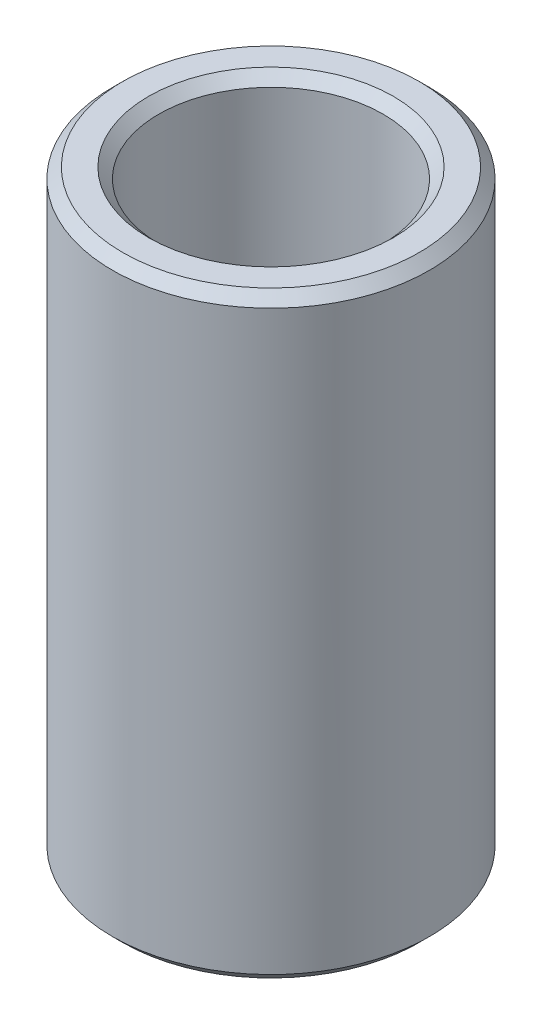
ISO-10303-21;
HEADER;
FILE_DESCRIPTION(('STEP AP214'),'2;1');
FILE_NAME('part.step','',(''),(''),'','','');
FILE_SCHEMA(('AUTOMOTIVE_DESIGN { 1 0 10303 214 1 1 1 1 }'));
ENDSEC;
DATA;
#1=APPLICATION_CONTEXT('core data for automotive mechanical design processes');
#2=APPLICATION_PROTOCOL_DEFINITION('international standard','automotive_design',2000,#1);
#3=PRODUCT_CONTEXT('',#1,'mechanical');
#4=PRODUCT('Part','Part','',(#3));
#5=PRODUCT_RELATED_PRODUCT_CATEGORY('part','',(#4));
#6=PRODUCT_DEFINITION_FORMATION('','',#4);
#7=PRODUCT_DEFINITION_CONTEXT('part definition',#1,'design');
#8=PRODUCT_DEFINITION('design','',#6,#7);
#9=PRODUCT_DEFINITION_SHAPE('','',#8);
#10=(LENGTH_UNIT() NAMED_UNIT(*) SI_UNIT(.MILLI.,.METRE.));
#11=(NAMED_UNIT(*) PLANE_ANGLE_UNIT() SI_UNIT($,.RADIAN.));
#12=(NAMED_UNIT(*) SI_UNIT($,.STERADIAN.) SOLID_ANGLE_UNIT());
#13=UNCERTAINTY_MEASURE_WITH_UNIT(LENGTH_MEASURE(1.E-05),#10,'distance_accuracy_value','');
#14=(GEOMETRIC_REPRESENTATION_CONTEXT(3) GLOBAL_UNCERTAINTY_ASSIGNED_CONTEXT((#13)) GLOBAL_UNIT_ASSIGNED_CONTEXT((#10,
#11,#12)) REPRESENTATION_CONTEXT('',''));
#15=CARTESIAN_POINT('',(0.,0.,0.));
#16=DIRECTION('',(0.,0.,1.));
#17=DIRECTION('',(1.,0.,0.));
#18=AXIS2_PLACEMENT_3D('',#15,#16,#17);
#19=CARTESIAN_POINT('',(0.,122.542267193147,0.));
#20=DIRECTION('',(0.,-1.,0.));
#21=DIRECTION('',(0.,0.,-1.));
#22=AXIS2_PLACEMENT_3D('',#19,#20,#21);
#23=CYLINDRICAL_SURFACE('',#22,32.5);
#24=CARTESIAN_POINT('',(0.,2.10416210140545,0.));
#25=DIRECTION('',(0.,1.,0.));
#26=DIRECTION('',(0.,0.,1.));
#27=AXIS2_PLACEMENT_3D('',#24,#25,#26);
#28=CIRCLE('',#27,32.5);
#29=CARTESIAN_POINT('',(0.,2.10416210140545,-32.5));
#30=VERTEX_POINT('',#29);
#31=EDGE_CURVE('E10',#30,#30,#28,.T.);
#32=CARTESIAN_POINT('',(0.,120.438105091742,0.));
#33=DIRECTION('',(0.,1.,0.));
#34=DIRECTION('',(0.,0.,1.));
#35=AXIS2_PLACEMENT_3D('',#32,#33,#34);
#36=CIRCLE('',#35,32.5);
#37=CARTESIAN_POINT('',(0.,120.438105091742,-32.5));
#38=VERTEX_POINT('',#37);
#39=EDGE_CURVE('E50',#38,#38,#36,.F.);
#40=CARTESIAN_POINT('',(0.,2.10416210140545,-32.5));
#41=CARTESIAN_POINT('',(0.,3.33680734088812,-32.5));
#42=CARTESIAN_POINT('',(0.,4.56945258037079,-32.5));
#43=CARTESIAN_POINT('',(0.,7.03474305933612,-32.5));
#44=CARTESIAN_POINT('',(0.,8.26738829881879,-32.5));
#45=CARTESIAN_POINT('',(0.,10.7326787777841,-32.5));
#46=CARTESIAN_POINT('',(0.,11.9653240172668,-32.5));
#47=CARTESIAN_POINT('',(0.,14.4306144962322,-32.5));
#48=CARTESIAN_POINT('',(0.,15.6632597357148,-32.5));
#49=CARTESIAN_POINT('',(0.,18.1285502146802,-32.5));
#50=CARTESIAN_POINT('',(0.,19.3611954541628,-32.5));
#51=CARTESIAN_POINT('',(0.,21.8264859331282,-32.5));
#52=CARTESIAN_POINT('',(0.,23.0591311726108,-32.5));
#53=CARTESIAN_POINT('',(0.,25.5244216515762,-32.5));
#54=CARTESIAN_POINT('',(0.,26.7570668910589,-32.5));
#55=CARTESIAN_POINT('',(0.,29.2223573700242,-32.5));
#56=CARTESIAN_POINT('',(0.,30.4550026095069,-32.5));
#57=CARTESIAN_POINT('',(0.,32.9202930884722,-32.5));
#58=CARTESIAN_POINT('',(0.,34.1529383279549,-32.5));
#59=CARTESIAN_POINT('',(0.,36.6182288069202,-32.5));
#60=CARTESIAN_POINT('',(0.,37.8508740464029,-32.5));
#61=CARTESIAN_POINT('',(0.,40.3161645253682,-32.5));
#62=CARTESIAN_POINT('',(0.,41.5488097648509,-32.5));
#63=CARTESIAN_POINT('',(0.,44.0141002438162,-32.5));
#64=CARTESIAN_POINT('',(0.,45.2467454832989,-32.5));
#65=CARTESIAN_POINT('',(0.,47.7120359622643,-32.5));
#66=CARTESIAN_POINT('',(0.,48.9446812017469,-32.5));
#67=CARTESIAN_POINT('',(0.,51.4099716807123,-32.5));
#68=CARTESIAN_POINT('',(0.,52.6426169201949,-32.5));
#69=CARTESIAN_POINT('',(0.,55.1079073991603,-32.5));
#70=CARTESIAN_POINT('',(0.,56.340552638643,-32.5));
#71=CARTESIAN_POINT('',(0.,58.8058431176083,-32.5));
#72=CARTESIAN_POINT('',(0.,60.038488357091,-32.5));
#73=CARTESIAN_POINT('',(0.,62.5037788360563,-32.5));
#74=CARTESIAN_POINT('',(0.,63.736424075539,-32.5));
#75=CARTESIAN_POINT('',(0.,66.2017145545043,-32.5));
#76=CARTESIAN_POINT('',(0.,67.434359793987,-32.5));
#77=CARTESIAN_POINT('',(0.,69.8996502729523,-32.5));
#78=CARTESIAN_POINT('',(0.,71.132295512435,-32.5));
#79=CARTESIAN_POINT('',(0.,73.5975859914003,-32.5));
#80=CARTESIAN_POINT('',(0.,74.830231230883,-32.5));
#81=CARTESIAN_POINT('',(0.,77.2955217098483,-32.5));
#82=CARTESIAN_POINT('',(0.,78.528166949331,-32.5));
#83=CARTESIAN_POINT('',(0.,80.9934574282964,-32.5));
#84=CARTESIAN_POINT('',(0.,82.226102667779,-32.5));
#85=CARTESIAN_POINT('',(0.,84.6913931467444,-32.5));
#86=CARTESIAN_POINT('',(0.,85.924038386227,-32.5));
#87=CARTESIAN_POINT('',(0.,88.3893288651924,-32.5));
#88=CARTESIAN_POINT('',(0.,89.621974104675,-32.5));
#89=CARTESIAN_POINT('',(0.,92.0872645836404,-32.5));
#90=CARTESIAN_POINT('',(0.,93.3199098231231,-32.5));
#91=CARTESIAN_POINT('',(0.,95.7852003020884,-32.5));
#92=CARTESIAN_POINT('',(0.,97.0178455415711,-32.5));
#93=CARTESIAN_POINT('',(0.,99.4831360205364,-32.5));
#94=CARTESIAN_POINT('',(0.,100.715781260019,-32.5));
#95=CARTESIAN_POINT('',(0.,103.181071738984,-32.5));
#96=CARTESIAN_POINT('',(0.,104.413716978467,-32.5));
#97=CARTESIAN_POINT('',(0.,106.879007457432,-32.5));
#98=CARTESIAN_POINT('',(0.,108.111652696915,-32.5));
#99=CARTESIAN_POINT('',(0.,110.57694317588,-32.5));
#100=CARTESIAN_POINT('',(0.,111.809588415363,-32.5));
#101=CARTESIAN_POINT('',(0.,114.274878894328,-32.5));
#102=CARTESIAN_POINT('',(0.,115.507524133811,-32.5));
#103=CARTESIAN_POINT('',(0.,117.972814612776,-32.5));
#104=CARTESIAN_POINT('',(0.,119.205459852259,-32.5));
#105=CARTESIAN_POINT('',(0.,120.438105091742,-32.5));
#106=B_SPLINE_CURVE_WITH_KNOTS('',3,(#40,#41,#42,#43,#44,#45,#46,#47,#48,#49,#50,#51,#52,#53,
#54,#55,#56,#57,#58,#59,#60,#61,#62,#63,#64,#65,#66,#67,#68,#69,#70,#71,#72,#73,#74,#75,#76,#77,
#78,#79,#80,#81,#82,#83,#84,#85,#86,#87,#88,#89,#90,#91,#92,#93,#94,#95,#96,#97,#98,#99,#100,
#101,#102,#103,#104,#105),.UNSPECIFIED.,.F.,.F.,(4,2,2,2,2,2,2,2,2,2,2,2,2,2,2,2,2,2,2,2,2,2,2,
2,2,2,2,2,2,2,2,2,4),(0.,3.69793571844801,7.39587143689602,11.093807155344,14.791742873792,
18.4896785922401,22.1876143106881,25.8855500291361,29.5834857475841,33.2814214660321,
36.9793571844801,40.6772929029281,44.3752286213761,48.0731643398242,51.7711000582722,
55.4690357767202,59.1669714951682,62.8649072136162,66.5628429320642,70.2607786505122,
73.9587143689602,77.6566500874083,81.3545858058563,85.0525215243043,88.7504572427523,
92.4483929612003,96.1463286796483,99.8442643980963,103.542200116544,107.240135834992,
110.93807155344,114.636007271888,118.333942990336),.UNSPECIFIED.);
#107=EDGE_CURVE('BSEAM39',#30,#38,#106,.T.);
#108=ORIENTED_EDGE('',*,*,#31,.T.);
#109=ORIENTED_EDGE('',*,*,#39,.T.);
#110=ORIENTED_EDGE('',*,*,#107,.T.);
#111=ORIENTED_EDGE('',*,*,#107,.F.);
#112=EDGE_LOOP('',(#108,#110,#109,#111));
#113=FACE_BOUND('',#112,.T.);
#114=ADVANCED_FACE('F39',(#113),#23,.T.);
#115=CARTESIAN_POINT('',(0.,122.542267193147,0.));
#116=DIRECTION('',(0.,1.,0.));
#117=DIRECTION('',(0.,0.,1.));
#118=AXIS2_PLACEMENT_3D('',#115,#116,#117);
#119=PLANE('',#118);
#120=CARTESIAN_POINT('',(0.,122.542267193147,0.));
#121=DIRECTION('',(0.,1.,0.));
#122=DIRECTION('',(0.,0.,1.));
#123=AXIS2_PLACEMENT_3D('',#120,#121,#122);
#124=CIRCLE('',#123,25.1047713459221);
#125=CARTESIAN_POINT('',(0.,122.542267193147,25.1047713459221));
#126=VERTEX_POINT('',#125);
#127=EDGE_CURVE('E58',#126,#126,#124,.F.);
#128=ORIENTED_EDGE('',*,*,#127,.T.);
#129=EDGE_LOOP('',(#128));
#130=FACE_BOUND('',#129,.T.);
#131=CARTESIAN_POINT('',(0.,122.542267193147,0.));
#132=DIRECTION('',(0.,1.,0.));
#133=DIRECTION('',(0.,0.,1.));
#134=AXIS2_PLACEMENT_3D('',#131,#132,#133);
#135=CIRCLE('',#134,30.3958378985948);
#136=CARTESIAN_POINT('',(0.,122.542267193147,30.3958378985948));
#137=VERTEX_POINT('',#136);
#138=EDGE_CURVE('E61',#137,#137,#135,.T.);
#139=ORIENTED_EDGE('',*,*,#138,.T.);
#140=EDGE_LOOP('',(#139));
#141=FACE_BOUND('',#140,.T.);
#142=ADVANCED_FACE('F88',(#130,#141),#119,.T.);
#143=CARTESIAN_POINT('',(0.,0.,0.));
#144=DIRECTION('',(0.,1.,0.));
#145=DIRECTION('',(0.,0.,1.));
#146=AXIS2_PLACEMENT_3D('',#143,#144,#145);
#147=PLANE('',#146);
#148=CARTESIAN_POINT('',(0.,0.,0.));
#149=DIRECTION('',(0.,1.,0.));
#150=DIRECTION('',(0.,0.,1.));
#151=AXIS2_PLACEMENT_3D('',#148,#149,#150);
#152=CIRCLE('',#151,25.104771345922);
#153=CARTESIAN_POINT('',(0.,0.,25.104771345922));
#154=VERTEX_POINT('',#153);
#155=EDGE_CURVE('E51',#154,#154,#152,.T.);
#156=ORIENTED_EDGE('',*,*,#155,.T.);
#157=EDGE_LOOP('',(#156));
#158=FACE_BOUND('',#157,.T.);
#159=CARTESIAN_POINT('',(0.,0.,0.));
#160=DIRECTION('',(0.,1.,0.));
#161=DIRECTION('',(0.,0.,1.));
#162=AXIS2_PLACEMENT_3D('',#159,#160,#161);
#163=CIRCLE('',#162,30.3958378985946);
#164=CARTESIAN_POINT('',(0.,0.,30.3958378985946));
#165=VERTEX_POINT('',#164);
#166=EDGE_CURVE('E54',#165,#165,#163,.F.);
#167=ORIENTED_EDGE('',*,*,#166,.T.);
#168=EDGE_LOOP('',(#167));
#169=FACE_BOUND('',#168,.T.);
#170=ADVANCED_FACE('F83',(#158,#169),#147,.F.);
#171=CARTESIAN_POINT('',(0.,122.542267193147,0.));
#172=DIRECTION('',(0.,-1.,0.));
#173=DIRECTION('',(0.,0.,-1.));
#174=AXIS2_PLACEMENT_3D('',#171,#172,#173);
#175=CYLINDRICAL_SURFACE('',#174,23.0006092445167);
#176=CARTESIAN_POINT('',(0.,120.438105091742,0.));
#177=DIRECTION('',(0.,1.,0.));
#178=DIRECTION('',(0.,0.,1.));
#179=AXIS2_PLACEMENT_3D('',#176,#177,#178);
#180=CIRCLE('',#179,23.0006092445167);
#181=CARTESIAN_POINT('',(0.,120.438105091742,-23.0006092445167));
#182=VERTEX_POINT('',#181);
#183=EDGE_CURVE('E67',#182,#182,#180,.T.);
#184=CARTESIAN_POINT('',(0.,2.10416210140529,0.));
#185=DIRECTION('',(0.,1.,0.));
#186=DIRECTION('',(0.,0.,1.));
#187=AXIS2_PLACEMENT_3D('',#184,#185,#186);
#188=CIRCLE('',#187,23.0006092445167);
#189=CARTESIAN_POINT('',(0.,2.10416210140528,-23.0006092445167));
#190=VERTEX_POINT('',#189);
#191=EDGE_CURVE('E69',#190,#190,#188,.F.);
#192=CARTESIAN_POINT('',(0.,120.438105091742,-23.0006092445167));
#193=CARTESIAN_POINT('',(0.,119.205459852259,-23.0006092445167));
#194=CARTESIAN_POINT('',(0.,117.972814612776,-23.0006092445167));
#195=CARTESIAN_POINT('',(0.,115.507524133811,-23.0006092445167));
#196=CARTESIAN_POINT('',(0.,114.274878894328,-23.0006092445167));
#197=CARTESIAN_POINT('',(0.,111.809588415363,-23.0006092445167));
#198=CARTESIAN_POINT('',(0.,110.57694317588,-23.0006092445167));
#199=CARTESIAN_POINT('',(0.,108.111652696915,-23.0006092445167));
#200=CARTESIAN_POINT('',(0.,106.879007457432,-23.0006092445167));
#201=CARTESIAN_POINT('',(0.,104.413716978467,-23.0006092445167));
#202=CARTESIAN_POINT('',(0.,103.181071738984,-23.0006092445167));
#203=CARTESIAN_POINT('',(0.,100.715781260019,-23.0006092445167));
#204=CARTESIAN_POINT('',(0.,99.4831360205363,-23.0006092445167));
#205=CARTESIAN_POINT('',(0.,97.017845541571,-23.0006092445167));
#206=CARTESIAN_POINT('',(0.,95.7852003020883,-23.0006092445167));
#207=CARTESIAN_POINT('',(0.,93.3199098231229,-23.0006092445167));
#208=CARTESIAN_POINT('',(0.,92.0872645836403,-23.0006092445167));
#209=CARTESIAN_POINT('',(0.,89.6219741046749,-23.0006092445167));
#210=CARTESIAN_POINT('',(0.,88.3893288651923,-23.0006092445167));
#211=CARTESIAN_POINT('',(0.,85.9240383862269,-23.0006092445167));
#212=CARTESIAN_POINT('',(0.,84.6913931467442,-23.0006092445167));
#213=CARTESIAN_POINT('',(0.,82.2261026677789,-23.0006092445167));
#214=CARTESIAN_POINT('',(0.,80.9934574282962,-23.0006092445167));
#215=CARTESIAN_POINT('',(0.,78.5281669493309,-23.0006092445167));
#216=CARTESIAN_POINT('',(0.,77.2955217098482,-23.0006092445167));
#217=CARTESIAN_POINT('',(0.,74.8302312308829,-23.0006092445167));
#218=CARTESIAN_POINT('',(0.,73.5975859914002,-23.0006092445167));
#219=CARTESIAN_POINT('',(0.,71.1322955124349,-23.0006092445167));
#220=CARTESIAN_POINT('',(0.,69.8996502729522,-23.0006092445167));
#221=CARTESIAN_POINT('',(0.,67.4343597939868,-23.0006092445167));
#222=CARTESIAN_POINT('',(0.,66.2017145545042,-23.0006092445167));
#223=CARTESIAN_POINT('',(0.,63.7364240755388,-23.0006092445167));
#224=CARTESIAN_POINT('',(0.,62.5037788360562,-23.0006092445167));
#225=CARTESIAN_POINT('',(0.,60.0384883570908,-23.0006092445167));
#226=CARTESIAN_POINT('',(0.,58.8058431176082,-23.0006092445167));
#227=CARTESIAN_POINT('',(0.,56.3405526386428,-23.0006092445167));
#228=CARTESIAN_POINT('',(0.,55.1079073991601,-23.0006092445167));
#229=CARTESIAN_POINT('',(0.,52.6426169201948,-23.0006092445167));
#230=CARTESIAN_POINT('',(0.,51.4099716807121,-23.0006092445167));
#231=CARTESIAN_POINT('',(0.,48.9446812017468,-23.0006092445167));
#232=CARTESIAN_POINT('',(0.,47.7120359622641,-23.0006092445167));
#233=CARTESIAN_POINT('',(0.,45.2467454832988,-23.0006092445167));
#234=CARTESIAN_POINT('',(0.,44.0141002438161,-23.0006092445167));
#235=CARTESIAN_POINT('',(0.,41.5488097648508,-23.0006092445167));
#236=CARTESIAN_POINT('',(0.,40.3161645253681,-23.0006092445167));
#237=CARTESIAN_POINT('',(0.,37.8508740464027,-23.0006092445167));
#238=CARTESIAN_POINT('',(0.,36.6182288069201,-23.0006092445167));
#239=CARTESIAN_POINT('',(0.,34.1529383279547,-23.0006092445167));
#240=CARTESIAN_POINT('',(0.,32.9202930884721,-23.0006092445167));
#241=CARTESIAN_POINT('',(0.,30.4550026095067,-23.0006092445167));
#242=CARTESIAN_POINT('',(0.,29.222357370024,-23.0006092445167));
#243=CARTESIAN_POINT('',(0.,26.7570668910587,-23.0006092445167));
#244=CARTESIAN_POINT('',(0.,25.524421651576,-23.0006092445167));
#245=CARTESIAN_POINT('',(0.,23.0591311726107,-23.0006092445167));
#246=CARTESIAN_POINT('',(0.,21.826485933128,-23.0006092445167));
#247=CARTESIAN_POINT('',(0.,19.3611954541627,-23.0006092445167));
#248=CARTESIAN_POINT('',(0.,18.12855021468,-23.0006092445167));
#249=CARTESIAN_POINT('',(0.,15.6632597357147,-23.0006092445167));
#250=CARTESIAN_POINT('',(0.,14.430614496232,-23.0006092445167));
#251=CARTESIAN_POINT('',(0.,11.9653240172667,-23.0006092445167));
#252=CARTESIAN_POINT('',(0.,10.732678777784,-23.0006092445167));
#253=CARTESIAN_POINT('',(0.,8.26738829881864,-23.0006092445167));
#254=CARTESIAN_POINT('',(0.,7.03474305933596,-23.0006092445167));
#255=CARTESIAN_POINT('',(0.,4.56945258037062,-23.0006092445167));
#256=CARTESIAN_POINT('',(0.,3.33680734088795,-23.0006092445167));
#257=CARTESIAN_POINT('',(0.,2.10416210140528,-23.0006092445167));
#258=B_SPLINE_CURVE_WITH_KNOTS('',3,(#192,#193,#194,#195,#196,#197,#198,#199,#200,#201,#202,
#203,#204,#205,#206,#207,#208,#209,#210,#211,#212,#213,#214,#215,#216,#217,#218,#219,#220,#221,
#222,#223,#224,#225,#226,#227,#228,#229,#230,#231,#232,#233,#234,#235,#236,#237,#238,#239,#240,
#241,#242,#243,#244,#245,#246,#247,#248,#249,#250,#251,#252,#253,#254,#255,#256,#257),
.UNSPECIFIED.,.F.,.F.,(4,2,2,2,2,2,2,2,2,2,2,2,2,2,2,2,2,2,2,2,2,2,2,2,2,2,2,2,2,2,2,2,4),(0.,
3.69793571844801,7.39587143689602,11.093807155344,14.791742873792,18.4896785922401,
22.1876143106881,25.8855500291361,29.5834857475841,33.2814214660321,36.9793571844801,
40.6772929029281,44.3752286213761,48.0731643398242,51.7711000582722,55.4690357767202,
59.1669714951682,62.8649072136162,66.5628429320642,70.2607786505123,73.9587143689603,
77.6566500874083,81.3545858058563,85.0525215243043,88.7504572427523,92.4483929612003,
96.1463286796483,99.8442643980964,103.542200116544,107.240135834992,110.93807155344,
114.636007271888,118.333942990336),.UNSPECIFIED.);
#259=EDGE_CURVE('BSEAM71',#182,#190,#258,.T.);
#260=ORIENTED_EDGE('',*,*,#183,.T.);
#261=ORIENTED_EDGE('',*,*,#191,.T.);
#262=ORIENTED_EDGE('',*,*,#259,.T.);
#263=ORIENTED_EDGE('',*,*,#259,.F.);
#264=EDGE_LOOP('',(#260,#262,#261,#263));
#265=FACE_BOUND('',#264,.T.);
#266=ADVANCED_FACE('F71',(#265),#175,.F.);
#267=CARTESIAN_POINT('',(0.,120.438105091742,0.));
#268=DIRECTION('',(0.,1.,0.));
#269=DIRECTION('',(0.,0.,1.));
#270=AXIS2_PLACEMENT_3D('',#267,#268,#269);
#271=CONICAL_SURFACE('',#270,23.0006092445167,0.785398163397455);
#272=ORIENTED_EDGE('',*,*,#127,.F.);
#273=EDGE_LOOP('',(#272));
#274=FACE_BOUND('',#273,.T.);
#275=ORIENTED_EDGE('',*,*,#183,.F.);
#276=EDGE_LOOP('',(#275));
#277=FACE_BOUND('',#276,.T.);
#278=ADVANCED_FACE('F77',(#274,#277),#271,.F.);
#279=CARTESIAN_POINT('',(0.,0.,0.));
#280=DIRECTION('',(0.,-1.,0.));
#281=DIRECTION('',(0.,0.,-1.));
#282=AXIS2_PLACEMENT_3D('',#279,#280,#281);
#283=CONICAL_SURFACE('',#282,25.104771345922,0.78539816339744);
#284=ORIENTED_EDGE('',*,*,#191,.F.);
#285=EDGE_LOOP('',(#284));
#286=FACE_BOUND('',#285,.T.);
#287=ORIENTED_EDGE('',*,*,#155,.F.);
#288=EDGE_LOOP('',(#287));
#289=FACE_BOUND('',#288,.T.);
#290=ADVANCED_FACE('F73',(#286,#289),#283,.F.);
#291=CARTESIAN_POINT('',(0.,2.10416210140545,0.));
#292=DIRECTION('',(0.,1.,0.));
#293=DIRECTION('',(0.,0.,1.));
#294=AXIS2_PLACEMENT_3D('',#291,#292,#293);
#295=CONICAL_SURFACE('',#294,32.5,0.785398163397448);
#296=ORIENTED_EDGE('',*,*,#166,.F.);
#297=EDGE_LOOP('',(#296));
#298=FACE_BOUND('',#297,.T.);
#299=ORIENTED_EDGE('',*,*,#31,.F.);
#300=EDGE_LOOP('',(#299));
#301=FACE_BOUND('',#300,.T.);
#302=ADVANCED_FACE('F76',(#298,#301),#295,.T.);
#303=CARTESIAN_POINT('',(0.,122.542267193147,0.));
#304=DIRECTION('',(0.,-1.,0.));
#305=DIRECTION('',(0.,0.,-1.));
#306=AXIS2_PLACEMENT_3D('',#303,#304,#305);
#307=CONICAL_SURFACE('',#306,30.3958378985948,0.785398163397437);
#308=ORIENTED_EDGE('',*,*,#39,.F.);
#309=EDGE_LOOP('',(#308));
#310=FACE_BOUND('',#309,.T.);
#311=ORIENTED_EDGE('',*,*,#138,.F.);
#312=EDGE_LOOP('',(#311));
#313=FACE_BOUND('',#312,.T.);
#314=ADVANCED_FACE('F45',(#310,#313),#307,.T.);
#315=CLOSED_SHELL('',(#114,#142,#170,#266,#278,#290,#302,#314));
#316=MANIFOLD_SOLID_BREP('B2',#315);
#317=ADVANCED_BREP_SHAPE_REPRESENTATION('',(#18,#316),#14);
#318=SHAPE_DEFINITION_REPRESENTATION(#9,#317);
ENDSEC;
END-ISO-10303-21;
